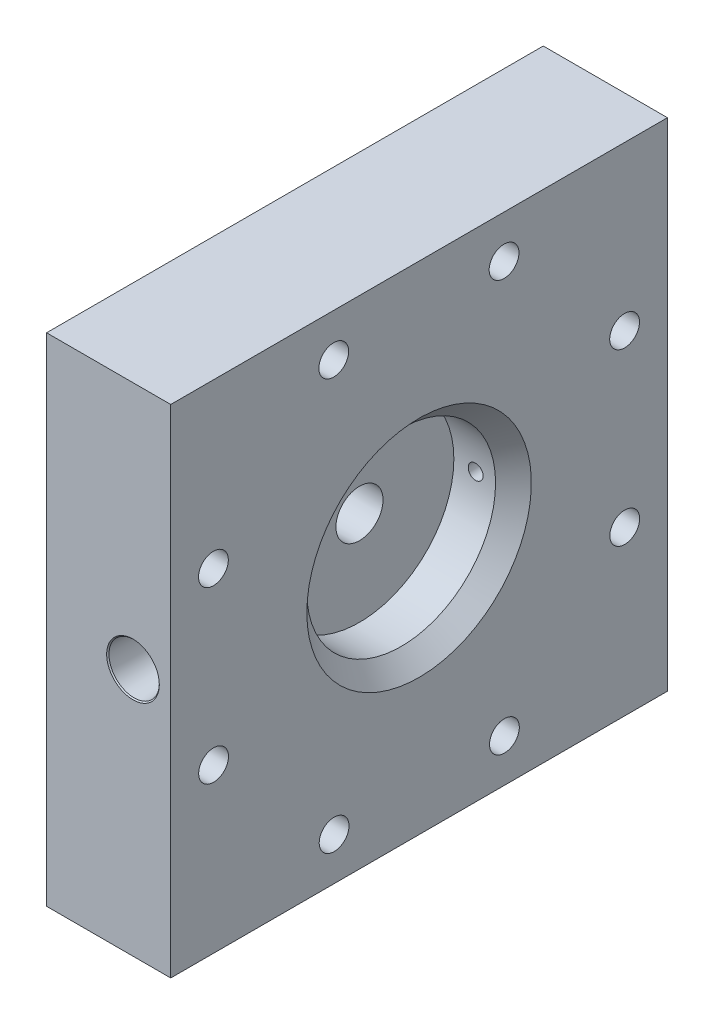
ISO-10303-21;
HEADER;
FILE_DESCRIPTION(('STEP AP214'),'2;1');
FILE_NAME('part.step','',(''),(''),'','','');
FILE_SCHEMA(('AUTOMOTIVE_DESIGN { 1 0 10303 214 1 1 1 1 }'));
ENDSEC;
DATA;
#1=APPLICATION_CONTEXT('core data for automotive mechanical design processes');
#2=APPLICATION_PROTOCOL_DEFINITION('international standard','automotive_design',2000,#1);
#3=PRODUCT_CONTEXT('',#1,'mechanical');
#4=PRODUCT('Part','Part','',(#3));
#5=PRODUCT_RELATED_PRODUCT_CATEGORY('part','',(#4));
#6=PRODUCT_DEFINITION_FORMATION('','',#4);
#7=PRODUCT_DEFINITION_CONTEXT('part definition',#1,'design');
#8=PRODUCT_DEFINITION('design','',#6,#7);
#9=PRODUCT_DEFINITION_SHAPE('','',#8);
#10=(LENGTH_UNIT() NAMED_UNIT(*) SI_UNIT(.MILLI.,.METRE.));
#11=(NAMED_UNIT(*) PLANE_ANGLE_UNIT() SI_UNIT($,.RADIAN.));
#12=(NAMED_UNIT(*) SI_UNIT($,.STERADIAN.) SOLID_ANGLE_UNIT());
#13=UNCERTAINTY_MEASURE_WITH_UNIT(LENGTH_MEASURE(1.E-05),#10,'distance_accuracy_value','');
#14=(GEOMETRIC_REPRESENTATION_CONTEXT(3) GLOBAL_UNCERTAINTY_ASSIGNED_CONTEXT((#13)) GLOBAL_UNIT_ASSIGNED_CONTEXT((#10,
#11,#12)) REPRESENTATION_CONTEXT('',''));
#15=CARTESIAN_POINT('',(0.,0.,0.));
#16=DIRECTION('',(0.,0.,1.));
#17=DIRECTION('',(1.,0.,0.));
#18=AXIS2_PLACEMENT_3D('',#15,#16,#17);
#19=CARTESIAN_POINT('',(-15.24,0.,0.));
#20=DIRECTION('',(1.,0.,0.));
#21=DIRECTION('',(0.,0.,-1.));
#22=AXIS2_PLACEMENT_3D('',#19,#20,#21);
#23=CYLINDRICAL_SURFACE('',#22,24.13);
#24=CARTESIAN_POINT('',(-11.557,0.,-24.13));
#25=CARTESIAN_POINT('',(-11.556995325564,0.106826226172943,-24.129999011352));
#26=CARTESIAN_POINT('',(-11.5479840789725,0.213725661990986,-24.129283034245));
#27=CARTESIAN_POINT('',(-11.5121683328076,0.424568237219932,-24.1264956971331));
#28=CARTESIAN_POINT('',(-11.4853435455417,0.528507864808426,-24.1244227917724));
#29=CARTESIAN_POINT('',(-11.4146800303673,0.73034655500601,-24.1191559058217));
#30=CARTESIAN_POINT('',(-11.3708507771266,0.828248946340492,-24.115962549627));
#31=CARTESIAN_POINT('',(-11.2674390726685,1.01528331461055,-24.1088131242689));
#32=CARTESIAN_POINT('',(-11.2078600467169,1.10441719274882,-24.1048572209951));
#33=CARTESIAN_POINT('',(-11.0744914992284,1.27161355485184,-24.0966165942948));
#34=CARTESIAN_POINT('',(-11.0006732338098,1.34965308025596,-24.0923312164842));
#35=CARTESIAN_POINT('',(-10.8409821381978,1.49224860927596,-24.0839201403949));
#36=CARTESIAN_POINT('',(-10.7551087849377,1.55680402751798,-24.079794449055));
#37=CARTESIAN_POINT('',(-10.573607667086,1.67067537712302,-24.0721626942508));
#38=CARTESIAN_POINT('',(-10.4779673258606,1.7199713217326,-24.0686574459886));
#39=CARTESIAN_POINT('',(-10.279734869153,1.80179668996642,-24.0626707102689));
#40=CARTESIAN_POINT('',(-10.1771428651822,1.83432638246537,-24.0601892063941));
#41=CARTESIAN_POINT('',(-9.96814788168544,1.88162974350117,-24.0565362645601));
#42=CARTESIAN_POINT('',(-9.86175336342215,1.89644058025379,-24.0553620846341));
#43=CARTESIAN_POINT('',(-9.64798247110973,1.90800060951392,-24.0544480090899));
#44=CARTESIAN_POINT('',(-9.54060611380399,1.90475010945183,-24.0547080890584));
#45=CARTESIAN_POINT('',(-9.32817393312756,1.88031047775107,-24.0566306614726));
#46=CARTESIAN_POINT('',(-9.22311343479365,1.8591616986429,-24.0582899991942));
#47=CARTESIAN_POINT('',(-9.01803808839669,1.79958851356738,-24.0628191619755));
#48=CARTESIAN_POINT('',(-8.91802328518451,1.76116395406681,-24.065688997793));
#49=CARTESIAN_POINT('',(-8.72574953492833,1.66808461170782,-24.0723194181394));
#50=CARTESIAN_POINT('',(-8.63349941064074,1.61341167747347,-24.0760809978969));
#51=CARTESIAN_POINT('',(-8.45947013467684,1.48940064822127,-24.0840701198221));
#52=CARTESIAN_POINT('',(-8.37769117304468,1.42006228709693,-24.0882976704444));
#53=CARTESIAN_POINT('',(-8.22669096406,1.26846211833128,-24.0967564074443));
#54=CARTESIAN_POINT('',(-8.15750474313264,1.18616541684066,-24.1009875720386));
#55=CARTESIAN_POINT('',(-8.03392462376757,1.0111065403748,-24.1089657151342));
#56=CARTESIAN_POINT('',(-7.97953073393508,0.918344359311472,-24.1127126933538));
#57=CARTESIAN_POINT('',(-7.88708168232635,0.724965288686751,-24.1193008806083));
#58=CARTESIAN_POINT('',(-7.84902801925965,0.624347679633035,-24.1221420065532));
#59=CARTESIAN_POINT('',(-7.79036388366253,0.418124140058263,-24.1265973811949));
#60=CARTESIAN_POINT('',(-7.769753086244,0.31251830248586,-24.1282116527429));
#61=CARTESIAN_POINT('',(-7.74660354130164,0.0996197390016049,-24.1300284967904));
#62=CARTESIAN_POINT('',(-7.7440164022684,-0.00766769419013197,-24.1302348493641));
#63=CARTESIAN_POINT('',(-7.75686092170936,-0.221150817142489,-24.1292226909866));
#64=CARTESIAN_POINT('',(-7.77229242957319,-0.327346516020977,-24.1280041919451));
#65=CARTESIAN_POINT('',(-7.82069609987958,-0.535494073622205,-24.1242818276586));
#66=CARTESIAN_POINT('',(-7.85364588546931,-0.637451167766453,-24.1217796023152));
#67=CARTESIAN_POINT('',(-7.9361279636865,-0.834389367323965,-24.115770972336));
#68=CARTESIAN_POINT('',(-7.98566049237256,-0.929370373407773,-24.1122645534053));
#69=CARTESIAN_POINT('',(-8.10002398889514,-1.10988078151531,-24.1046313941248));
#70=CARTESIAN_POINT('',(-8.16488707653208,-1.19538977820806,-24.1005033580752));
#71=CARTESIAN_POINT('',(-8.30802398557542,-1.35432303419914,-24.0920952913192));
#72=CARTESIAN_POINT('',(-8.38629801614237,-1.4277471049828,-24.0878152582431));
#73=CARTESIAN_POINT('',(-8.55424460829666,-1.56059177959214,-24.0795744446698));
#74=CARTESIAN_POINT('',(-8.64394215515525,-1.61998084788506,-24.0756143960366));
#75=CARTESIAN_POINT('',(-8.83206495304487,-1.72285357630273,-24.0684720323659));
#76=CARTESIAN_POINT('',(-8.93049012461906,-1.76633738121152,-24.0652897102488));
#77=CARTESIAN_POINT('',(-9.13316175663511,-1.83611130814894,-24.0600670512582));
#78=CARTESIAN_POINT('',(-9.23740149277564,-1.86242086168388,-24.0580254241435));
#79=CARTESIAN_POINT('',(-9.448835655013,-1.89716276665092,-24.0553108867109));
#80=CARTESIAN_POINT('',(-9.5560300307975,-1.90559542230508,-24.0546379531011));
#81=CARTESIAN_POINT('',(-9.77001720042872,-1.90434079817309,-24.0547372870641));
#82=CARTESIAN_POINT('',(-9.87681029015598,-1.89470307269392,-24.055505602311));
#83=CARTESIAN_POINT('',(-10.0872562243671,-1.85768446011846,-24.0583924711154));
#84=CARTESIAN_POINT('',(-10.1909090638186,-1.83030354458974,-24.0605110268367));
#85=CARTESIAN_POINT('',(-10.3921363130125,-1.75858805644799,-24.0658586375874));
#86=CARTESIAN_POINT('',(-10.4897109909264,-1.71425423242271,-24.0690876435821));
#87=CARTESIAN_POINT('',(-10.6760402309025,-1.60989714620257,-24.0762923801623));
#88=CARTESIAN_POINT('',(-10.7647949523223,-1.54987416754795,-24.0802680972526));
#89=CARTESIAN_POINT('',(-10.9312181698313,-1.41565669612741,-24.088531209571));
#90=CARTESIAN_POINT('',(-11.008857132073,-1.3414256315595,-24.0928193910498));
#91=CARTESIAN_POINT('',(-11.1506035314281,-1.18096299810164,-24.1012171237977));
#92=CARTESIAN_POINT('',(-11.2147076815479,-1.0947285225436,-24.105326631483));
#93=CARTESIAN_POINT('',(-11.3276414453039,-0.912556953458347,-24.1129106343319));
#94=CARTESIAN_POINT('',(-11.3764447123768,-0.816603496532759,-24.116384029946));
#95=CARTESIAN_POINT('',(-11.4571856212062,-0.617903301001842,-24.1222912249227));
#96=CARTESIAN_POINT('',(-11.4891427356211,-0.515164560914645,-24.1247262239547));
#97=CARTESIAN_POINT('',(-11.5271060832324,-0.343178619296865,-24.127654108437));
#98=CARTESIAN_POINT('',(-11.5383014973731,-0.275038882367978,-24.128529835367));
#99=CARTESIAN_POINT('',(-11.5532499563865,-0.137942939414719,-24.1297030996988));
#100=CARTESIAN_POINT('',(-11.5570030186789,-0.0689867353017567,-24.1300006384537));
#101=CARTESIAN_POINT('',(-11.557,0.,-24.13));
#102=B_SPLINE_CURVE_WITH_KNOTS('',3,(#24,#25,#26,#27,#28,#29,#30,#31,#32,#33,#34,#35,#36,#37,
#38,#39,#40,#41,#42,#43,#44,#45,#46,#47,#48,#49,#50,#51,#52,#53,#54,#55,#56,#57,#58,#59,#60,#61,
#62,#63,#64,#65,#66,#67,#68,#69,#70,#71,#72,#73,#74,#75,#76,#77,#78,#79,#80,#81,#82,#83,#84,#85,
#86,#87,#88,#89,#90,#91,#92,#93,#94,#95,#96,#97,#98,#99,#100,#101),.UNSPECIFIED.,.T.,.F.,(4,2,2,
2,2,2,2,2,2,2,2,2,2,2,2,2,2,2,2,2,2,2,2,2,2,2,2,2,2,2,2,2,2,2,2,2,2,2,4),(0.,0.320226809727181,
0.640818949999914,0.961232716443689,1.28157685644303,1.60257455387096,1.9235861835987,
2.24501651023551,2.56644168204244,2.88719142277237,3.2079357038884,3.52795877212784,
3.84798468453082,4.16836945662308,4.48876004264693,4.81002860540227,5.13129735505038,
5.45259556486168,5.77388779009066,6.09431704797972,6.41474362755331,6.73476189230492,
7.05478471277313,7.37548406701352,7.69618842341991,8.01760666757768,8.33902198582403,
8.66007301109804,8.98111857280737,9.30128502046014,9.62145198116228,9.9416048059184,
10.2617518451535,10.5827343072053,10.9037946319458,11.2254047916447,11.5466423788078,
11.7534404157516,11.9602379686616),.UNSPECIFIED.);
#103=CARTESIAN_POINT('',(-11.557,0.,-24.13));
#104=VERTEX_POINT('',#103);
#105=EDGE_CURVE('E250',#104,#104,#102,.T.);
#106=ORIENTED_EDGE('',*,*,#105,.T.);
#107=EDGE_LOOP('',(#106));
#108=FACE_BOUND('',#107,.T.);
#109=CARTESIAN_POINT('',(-4.57200000000006,0.,0.));
#110=DIRECTION('',(-1.,0.,0.));
#111=DIRECTION('',(0.,0.,1.));
#112=AXIS2_PLACEMENT_3D('',#109,#110,#111);
#113=CIRCLE('',#112,24.13);
#114=CARTESIAN_POINT('',(-4.57200000000006,0.,24.13));
#115=VERTEX_POINT('',#114);
#116=EDGE_CURVE('E55',#115,#115,#113,.F.);
#117=ORIENTED_EDGE('',*,*,#116,.T.);
#118=EDGE_LOOP('',(#117));
#119=FACE_BOUND('',#118,.T.);
#120=CARTESIAN_POINT('',(-15.24,0.,0.));
#121=DIRECTION('',(1.,0.,0.));
#122=DIRECTION('',(0.,0.,-1.));
#123=AXIS2_PLACEMENT_3D('',#120,#121,#122);
#124=CIRCLE('',#123,24.13);
#125=CARTESIAN_POINT('',(-15.24,0.,-24.13));
#126=VERTEX_POINT('',#125);
#127=EDGE_CURVE('E110',#126,#126,#124,.T.);
#128=ORIENTED_EDGE('',*,*,#127,.F.);
#129=EDGE_LOOP('',(#128));
#130=FACE_BOUND('',#129,.T.);
#131=CARTESIAN_POINT('',(-7.74699999999997,0.,24.13));
#132=CARTESIAN_POINT('',(-7.74700467443597,-0.106826226172944,24.129999011352));
#133=CARTESIAN_POINT('',(-7.75601592102745,-0.213725661990986,24.129283034245));
#134=CARTESIAN_POINT('',(-7.79183166719235,-0.424568237219932,24.1264956971331));
#135=CARTESIAN_POINT('',(-7.81865645445828,-0.528507864808426,24.1244227917724));
#136=CARTESIAN_POINT('',(-7.88931996963259,-0.73034655500601,24.1191559058217));
#137=CARTESIAN_POINT('',(-7.93314922287336,-0.828248946340492,24.115962549627));
#138=CARTESIAN_POINT('',(-8.03656092733144,-1.01528331461055,24.1088131242689));
#139=CARTESIAN_POINT('',(-8.09613995328301,-1.10441719274882,24.1048572209951));
#140=CARTESIAN_POINT('',(-8.22950850077149,-1.27161355485184,24.0966165942948));
#141=CARTESIAN_POINT('',(-8.30332676619009,-1.34965308025596,24.0923312164842));
#142=CARTESIAN_POINT('',(-8.46301786180214,-1.49224860927596,24.0839201403949));
#143=CARTESIAN_POINT('',(-8.54889121506219,-1.55680402751798,24.079794449055));
#144=CARTESIAN_POINT('',(-8.73039233291389,-1.67067537712302,24.0721626942508));
#145=CARTESIAN_POINT('',(-8.82603267413938,-1.7199713217326,24.0686574459886));
#146=CARTESIAN_POINT('',(-9.02426513084695,-1.80179668996642,24.0626707102689));
#147=CARTESIAN_POINT('',(-9.1268571348177,-1.83432638246537,24.0601892063941));
#148=CARTESIAN_POINT('',(-9.33585211831449,-1.88162974350117,24.0565362645601));
#149=CARTESIAN_POINT('',(-9.44224663657778,-1.89644058025379,24.0553620846341));
#150=CARTESIAN_POINT('',(-9.6560175288902,-1.90800060951392,24.0544480090899));
#151=CARTESIAN_POINT('',(-9.76339388619594,-1.90475010945183,24.0547080890584));
#152=CARTESIAN_POINT('',(-9.97582606687237,-1.88031047775107,24.0566306614726));
#153=CARTESIAN_POINT('',(-10.0808865652063,-1.8591616986429,24.0582899991942));
#154=CARTESIAN_POINT('',(-10.2859619116032,-1.79958851356738,24.0628191619755));
#155=CARTESIAN_POINT('',(-10.3859767148154,-1.76116395406681,24.065688997793));
#156=CARTESIAN_POINT('',(-10.5782504650716,-1.66808461170782,24.0723194181394));
#157=CARTESIAN_POINT('',(-10.6705005893592,-1.61341167747347,24.0760809978969));
#158=CARTESIAN_POINT('',(-10.8445298653231,-1.48940064822127,24.0840701198221));
#159=CARTESIAN_POINT('',(-10.9263088269553,-1.42006228709693,24.0882976704444));
#160=CARTESIAN_POINT('',(-11.0773090359399,-1.26846211833128,24.0967564074443));
#161=CARTESIAN_POINT('',(-11.1464952568673,-1.18616541684066,24.1009875720386));
#162=CARTESIAN_POINT('',(-11.2700753762324,-1.0111065403748,24.1089657151342));
#163=CARTESIAN_POINT('',(-11.3244692660649,-0.918344359311472,24.1127126933538));
#164=CARTESIAN_POINT('',(-11.4169183176736,-0.724965288686751,24.1193008806083));
#165=CARTESIAN_POINT('',(-11.4549719807403,-0.624347679633035,24.1221420065532));
#166=CARTESIAN_POINT('',(-11.5136361163374,-0.418124140058263,24.1265973811949));
#167=CARTESIAN_POINT('',(-11.5342469137559,-0.31251830248586,24.1282116527429));
#168=CARTESIAN_POINT('',(-11.5573964586983,-0.0996197390016042,24.1300284967904));
#169=CARTESIAN_POINT('',(-11.5599835977315,0.00766769419013236,24.1302348493641));
#170=CARTESIAN_POINT('',(-11.5471390782906,0.221150817142489,24.1292226909866));
#171=CARTESIAN_POINT('',(-11.5317075704267,0.327346516020978,24.1280041919451));
#172=CARTESIAN_POINT('',(-11.4833039001204,0.535494073622205,24.1242818276586));
#173=CARTESIAN_POINT('',(-11.4503541145306,0.637451167766453,24.1217796023152));
#174=CARTESIAN_POINT('',(-11.3678720363134,0.834389367323965,24.115770972336));
#175=CARTESIAN_POINT('',(-11.3183395076274,0.929370373407774,24.1122645534053));
#176=CARTESIAN_POINT('',(-11.2039760111048,1.10988078151531,24.1046313941248));
#177=CARTESIAN_POINT('',(-11.1391129234678,1.19538977820806,24.1005033580752));
#178=CARTESIAN_POINT('',(-10.9959760144245,1.35432303419914,24.0920952913192));
#179=CARTESIAN_POINT('',(-10.9177019838576,1.4277471049828,24.0878152582431));
#180=CARTESIAN_POINT('',(-10.7497553917033,1.56059177959214,24.0795744446698));
#181=CARTESIAN_POINT('',(-10.6600578448447,1.61998084788506,24.0756143960366));
#182=CARTESIAN_POINT('',(-10.4719350469551,1.72285357630273,24.0684720323659));
#183=CARTESIAN_POINT('',(-10.3735098753809,1.76633738121152,24.0652897102488));
#184=CARTESIAN_POINT('',(-10.1708382433648,1.83611130814894,24.0600670512582));
#185=CARTESIAN_POINT('',(-10.0665985072243,1.86242086168388,24.0580254241435));
#186=CARTESIAN_POINT('',(-9.85516434498693,1.89716276665092,24.0553108867109));
#187=CARTESIAN_POINT('',(-9.74796996920243,1.90559542230508,24.0546379531011));
#188=CARTESIAN_POINT('',(-9.53398279957121,1.90434079817309,24.0547372870641));
#189=CARTESIAN_POINT('',(-9.42718970984395,1.89470307269392,24.055505602311));
#190=CARTESIAN_POINT('',(-9.21674377563283,1.85768446011846,24.0583924711154));
#191=CARTESIAN_POINT('',(-9.11309093618132,1.83030354458974,24.0605110268367));
#192=CARTESIAN_POINT('',(-8.91186368698745,1.75858805644799,24.0658586375874));
#193=CARTESIAN_POINT('',(-8.81428900907356,1.71425423242271,24.0690876435821));
#194=CARTESIAN_POINT('',(-8.62795976909744,1.60989714620257,24.0762923801623));
#195=CARTESIAN_POINT('',(-8.53920504767766,1.54987416754795,24.0802680972526));
#196=CARTESIAN_POINT('',(-8.37278183016863,1.41565669612741,24.088531209571));
#197=CARTESIAN_POINT('',(-8.29514286792697,1.3414256315595,24.0928193910498));
#198=CARTESIAN_POINT('',(-8.15339646857182,1.18096299810164,24.1012171237977));
#199=CARTESIAN_POINT('',(-8.08929231845207,1.0947285225436,24.105326631483));
#200=CARTESIAN_POINT('',(-7.97635855469602,0.912556953458346,24.1129106343319));
#201=CARTESIAN_POINT('',(-7.92755528762315,0.816603496532758,24.116384029946));
#202=CARTESIAN_POINT('',(-7.84681437879378,0.617903301001841,24.1222912249227));
#203=CARTESIAN_POINT('',(-7.81485726437881,0.515164560914645,24.1247262239547));
#204=CARTESIAN_POINT('',(-7.77689391676755,0.343178619296865,24.127654108437));
#205=CARTESIAN_POINT('',(-7.76569850262684,0.275038882367978,24.128529835367));
#206=CARTESIAN_POINT('',(-7.75075004361339,0.137942939414719,24.1297030996988));
#207=CARTESIAN_POINT('',(-7.74699698132103,0.0689867353017568,24.1300006384537));
#208=CARTESIAN_POINT('',(-7.74699999999997,0.,24.13));
#209=B_SPLINE_CURVE_WITH_KNOTS('',3,(#131,#132,#133,#134,#135,#136,#137,#138,#139,#140,#141,
#142,#143,#144,#145,#146,#147,#148,#149,#150,#151,#152,#153,#154,#155,#156,#157,#158,#159,#160,
#161,#162,#163,#164,#165,#166,#167,#168,#169,#170,#171,#172,#173,#174,#175,#176,#177,#178,#179,
#180,#181,#182,#183,#184,#185,#186,#187,#188,#189,#190,#191,#192,#193,#194,#195,#196,#197,#198,
#199,#200,#201,#202,#203,#204,#205,#206,#207,#208),.UNSPECIFIED.,.T.,.F.,(4,2,2,2,2,2,2,2,2,2,2,
2,2,2,2,2,2,2,2,2,2,2,2,2,2,2,2,2,2,2,2,2,2,2,2,2,2,2,4),(0.,0.320226809727181,
0.640818949999914,0.961232716443689,1.28157685644303,1.60257455387096,1.9235861835987,
2.24501651023551,2.56644168204244,2.88719142277237,3.2079357038884,3.52795877212784,
3.84798468453082,4.16836945662308,4.48876004264693,4.81002860540227,5.13129735505038,
5.45259556486168,5.77388779009066,6.09431704797972,6.41474362755331,6.73476189230492,
7.05478471277313,7.37548406701353,7.69618842341991,8.01760666757768,8.33902198582403,
8.66007301109804,8.98111857280738,9.30128502046014,9.62145198116228,9.9416048059184,
10.2617518451535,10.5827343072054,10.9037946319458,11.2254047916447,11.5466423788078,
11.7534404157516,11.9602379686616),.UNSPECIFIED.);
#210=CARTESIAN_POINT('',(-7.74699999999997,0.,24.13));
#211=VERTEX_POINT('',#210);
#212=EDGE_CURVE('E115',#211,#211,#209,.T.);
#213=ORIENTED_EDGE('',*,*,#212,.F.);
#214=EDGE_LOOP('',(#213));
#215=FACE_BOUND('',#214,.T.);
#216=ADVANCED_FACE('F45',(#108,#119,#130,#215),#23,.F.);
#217=CARTESIAN_POINT('',(-31.75,0.,0.));
#218=DIRECTION('',(-1.,0.,0.));
#219=DIRECTION('',(0.,0.,1.));
#220=AXIS2_PLACEMENT_3D('',#217,#218,#219);
#221=PLANE('',#220);
#222=CARTESIAN_POINT('',(-31.75,0.,0.));
#223=DIRECTION('',(-1.,0.,0.));
#224=DIRECTION('',(0.,0.,1.));
#225=AXIS2_PLACEMENT_3D('',#222,#223,#224);
#226=CIRCLE('',#225,6.731);
#227=CARTESIAN_POINT('',(-31.75,0.,6.731));
#228=VERTEX_POINT('',#227);
#229=EDGE_CURVE('E181',#228,#228,#226,.T.);
#230=ORIENTED_EDGE('',*,*,#229,.F.);
#231=EDGE_LOOP('',(#230));
#232=FACE_BOUND('',#231,.T.);
#233=CARTESIAN_POINT('',(-31.75,52.546029205355,21.8190199310139));
#234=DIRECTION('',(-1.,0.,0.));
#235=DIRECTION('',(0.,-0.707106781186539,0.707106781186556));
#236=AXIS2_PLACEMENT_3D('',#233,#234,#235);
#237=CIRCLE('',#236,3.81);
#238=CARTESIAN_POINT('',(-31.75,49.8519523690343,24.5130967673347));
#239=VERTEX_POINT('',#238);
#240=EDGE_CURVE('E162',#239,#239,#237,.T.);
#241=ORIENTED_EDGE('',*,*,#240,.F.);
#242=EDGE_LOOP('',(#241));
#243=FACE_BOUND('',#242,.T.);
#244=CARTESIAN_POINT('',(-31.75,21.7272766234684,52.5840305275973));
#245=DIRECTION('',(-1.,0.,0.));
#246=DIRECTION('',(0.,-1.,0.));
#247=AXIS2_PLACEMENT_3D('',#244,#245,#246);
#248=CIRCLE('',#247,3.81);
#249=CARTESIAN_POINT('',(-31.75,17.9172766234684,52.5840305275973));
#250=VERTEX_POINT('',#249);
#251=EDGE_CURVE('E156',#250,#250,#248,.T.);
#252=ORIENTED_EDGE('',*,*,#251,.F.);
#253=EDGE_LOOP('',(#252));
#254=FACE_BOUND('',#253,.T.);
#255=CARTESIAN_POINT('',(-31.75,-21.8190199310141,52.5460292053549));
#256=DIRECTION('',(-1.,0.,0.));
#257=DIRECTION('',(0.,-0.707106781186554,-0.707106781186541));
#258=AXIS2_PLACEMENT_3D('',#255,#256,#257);
#259=CIRCLE('',#258,3.81);
#260=CARTESIAN_POINT('',(-31.75,-24.5130967673349,49.8519523690342));
#261=VERTEX_POINT('',#260);
#262=EDGE_CURVE('E150',#261,#261,#259,.T.);
#263=ORIENTED_EDGE('',*,*,#262,.F.);
#264=EDGE_LOOP('',(#263));
#265=FACE_BOUND('',#264,.T.);
#266=CARTESIAN_POINT('',(-31.75,-52.5840305275975,21.7272766234679));
#267=DIRECTION('',(-1.,0.,0.));
#268=DIRECTION('',(0.,0.,-1.));
#269=AXIS2_PLACEMENT_3D('',#266,#267,#268);
#270=CIRCLE('',#269,3.81);
#271=CARTESIAN_POINT('',(-31.75,-52.5840305275975,17.9172766234679));
#272=VERTEX_POINT('',#271);
#273=EDGE_CURVE('E144',#272,#272,#270,.T.);
#274=ORIENTED_EDGE('',*,*,#273,.F.);
#275=EDGE_LOOP('',(#274));
#276=FACE_BOUND('',#275,.T.);
#277=CARTESIAN_POINT('',(-31.75,-52.5460292053548,-21.8190199310143));
#278=DIRECTION('',(-1.,0.,0.));
#279=DIRECTION('',(0.,0.707106781186544,-0.707106781186551));
#280=AXIS2_PLACEMENT_3D('',#277,#278,#279);
#281=CIRCLE('',#280,3.81);
#282=CARTESIAN_POINT('',(-31.75,-49.8519523690341,-24.513096767335));
#283=VERTEX_POINT('',#282);
#284=EDGE_CURVE('E138',#283,#283,#281,.T.);
#285=ORIENTED_EDGE('',*,*,#284,.F.);
#286=EDGE_LOOP('',(#285));
#287=FACE_BOUND('',#286,.T.);
#288=CARTESIAN_POINT('',(-31.75,-21.727276623468,-52.5840305275974));
#289=DIRECTION('',(-1.,0.,0.));
#290=DIRECTION('',(0.,1.,0.));
#291=AXIS2_PLACEMENT_3D('',#288,#289,#290);
#292=CIRCLE('',#291,3.81);
#293=CARTESIAN_POINT('',(-31.75,-17.917276623468,-52.5840305275974));
#294=VERTEX_POINT('',#293);
#295=EDGE_CURVE('E131',#294,#294,#292,.T.);
#296=ORIENTED_EDGE('',*,*,#295,.F.);
#297=EDGE_LOOP('',(#296));
#298=FACE_BOUND('',#297,.T.);
#299=CARTESIAN_POINT('',(-31.75,21.8190199310145,-52.5460292053547));
#300=DIRECTION('',(-1.,0.,0.));
#301=DIRECTION('',(0.,0.707106781186549,0.707106781186546));
#302=AXIS2_PLACEMENT_3D('',#299,#300,#301);
#303=CIRCLE('',#302,3.81);
#304=CARTESIAN_POINT('',(-31.75,24.5130967673352,-49.851952369034));
#305=VERTEX_POINT('',#304);
#306=EDGE_CURVE('E167',#305,#305,#303,.T.);
#307=ORIENTED_EDGE('',*,*,#306,.F.);
#308=EDGE_LOOP('',(#307));
#309=FACE_BOUND('',#308,.T.);
#310=CARTESIAN_POINT('',(-31.75,52.5840305275975,-21.7272766234679));
#311=DIRECTION('',(-1.,0.,0.));
#312=DIRECTION('',(0.,0.,1.));
#313=AXIS2_PLACEMENT_3D('',#310,#311,#312);
#314=CIRCLE('',#313,3.81);
#315=CARTESIAN_POINT('',(-31.75,52.5840305275975,-17.9172766234679));
#316=VERTEX_POINT('',#315);
#317=EDGE_CURVE('E173',#316,#316,#314,.T.);
#318=ORIENTED_EDGE('',*,*,#317,.F.);
#319=EDGE_LOOP('',(#318));
#320=FACE_BOUND('',#319,.T.);
#321=DIRECTION('',(0.,1.,0.));
#322=VECTOR('',#321,1.);
#323=CARTESIAN_POINT('',(-31.75,0.,-63.5));
#324=LINE('',#323,#322);
#325=CARTESIAN_POINT('',(-31.75,-63.5,-63.5));
#326=VERTEX_POINT('',#325);
#327=CARTESIAN_POINT('',(-31.75,63.5,-63.5));
#328=VERTEX_POINT('',#327);
#329=EDGE_CURVE('E89',#326,#328,#324,.T.);
#330=ORIENTED_EDGE('',*,*,#329,.F.);
#331=DIRECTION('',(0.,0.,1.));
#332=VECTOR('',#331,1.);
#333=CARTESIAN_POINT('',(-31.75,-63.5,0.));
#334=LINE('',#333,#332);
#335=CARTESIAN_POINT('',(-31.75,-63.5,63.5));
#336=VERTEX_POINT('',#335);
#337=EDGE_CURVE('E93',#326,#336,#334,.T.);
#338=ORIENTED_EDGE('',*,*,#337,.T.);
#339=DIRECTION('',(0.,1.,0.));
#340=VECTOR('',#339,1.);
#341=CARTESIAN_POINT('',(-31.75,0.,63.5));
#342=LINE('',#341,#340);
#343=CARTESIAN_POINT('',(-31.75,63.5000000000001,63.5));
#344=VERTEX_POINT('',#343);
#345=EDGE_CURVE('E106',#336,#344,#342,.T.);
#346=ORIENTED_EDGE('',*,*,#345,.T.);
#347=DIRECTION('',(0.,0.,1.));
#348=VECTOR('',#347,1.);
#349=CARTESIAN_POINT('',(-31.75,63.5,0.));
#350=LINE('',#349,#348);
#351=EDGE_CURVE('E94',#328,#344,#350,.T.);
#352=ORIENTED_EDGE('',*,*,#351,.F.);
#353=EDGE_LOOP('',(#330,#338,#346,#352));
#354=FACE_BOUND('',#353,.T.);
#355=ADVANCED_FACE('F91',(#232,#243,#254,#265,#276,#287,#298,#309,#320,#354),#221,.T.);
#356=CARTESIAN_POINT('',(0.,0.,0.));
#357=DIRECTION('',(-1.,0.,0.));
#358=DIRECTION('',(0.,0.,1.));
#359=AXIS2_PLACEMENT_3D('',#356,#357,#358);
#360=PLANE('',#359);
#361=CARTESIAN_POINT('',(0.,0.,0.));
#362=DIRECTION('',(-1.,0.,0.));
#363=DIRECTION('',(0.,0.,1.));
#364=AXIS2_PLACEMENT_3D('',#361,#362,#363);
#365=CIRCLE('',#364,28.7020000000001);
#366=CARTESIAN_POINT('',(0.,0.,28.7020000000001));
#367=VERTEX_POINT('',#366);
#368=EDGE_CURVE('E11',#367,#367,#365,.T.);
#369=ORIENTED_EDGE('',*,*,#368,.T.);
#370=EDGE_LOOP('',(#369));
#371=FACE_BOUND('',#370,.T.);
#372=CARTESIAN_POINT('',(0.,52.546029205355,21.8190199310139));
#373=DIRECTION('',(-1.,0.,0.));
#374=DIRECTION('',(0.,-0.707106781186539,0.707106781186556));
#375=AXIS2_PLACEMENT_3D('',#372,#373,#374);
#376=CIRCLE('',#375,3.81);
#377=CARTESIAN_POINT('',(0.,49.8519523690343,24.5130967673347));
#378=VERTEX_POINT('',#377);
#379=EDGE_CURVE('E127',#378,#378,#376,.T.);
#380=ORIENTED_EDGE('',*,*,#379,.T.);
#381=EDGE_LOOP('',(#380));
#382=FACE_BOUND('',#381,.T.);
#383=CARTESIAN_POINT('',(0.,21.7272766234684,52.5840305275973));
#384=DIRECTION('',(-1.,0.,0.));
#385=DIRECTION('',(0.,-1.,0.));
#386=AXIS2_PLACEMENT_3D('',#383,#384,#385);
#387=CIRCLE('',#386,3.81);
#388=CARTESIAN_POINT('',(0.,17.9172766234684,52.5840305275973));
#389=VERTEX_POINT('',#388);
#390=EDGE_CURVE('E159',#389,#389,#387,.T.);
#391=ORIENTED_EDGE('',*,*,#390,.T.);
#392=EDGE_LOOP('',(#391));
#393=FACE_BOUND('',#392,.T.);
#394=CARTESIAN_POINT('',(0.,-21.8190199310141,52.5460292053549));
#395=DIRECTION('',(-1.,0.,0.));
#396=DIRECTION('',(0.,-0.707106781186554,-0.707106781186541));
#397=AXIS2_PLACEMENT_3D('',#394,#395,#396);
#398=CIRCLE('',#397,3.81);
#399=CARTESIAN_POINT('',(0.,-24.5130967673349,49.8519523690342));
#400=VERTEX_POINT('',#399);
#401=EDGE_CURVE('E153',#400,#400,#398,.T.);
#402=ORIENTED_EDGE('',*,*,#401,.T.);
#403=EDGE_LOOP('',(#402));
#404=FACE_BOUND('',#403,.T.);
#405=CARTESIAN_POINT('',(0.,-52.5840305275975,21.7272766234679));
#406=DIRECTION('',(-1.,0.,0.));
#407=DIRECTION('',(0.,0.,-1.));
#408=AXIS2_PLACEMENT_3D('',#405,#406,#407);
#409=CIRCLE('',#408,3.81);
#410=CARTESIAN_POINT('',(0.,-52.5840305275975,17.9172766234679));
#411=VERTEX_POINT('',#410);
#412=EDGE_CURVE('E147',#411,#411,#409,.T.);
#413=ORIENTED_EDGE('',*,*,#412,.T.);
#414=EDGE_LOOP('',(#413));
#415=FACE_BOUND('',#414,.T.);
#416=CARTESIAN_POINT('',(0.,-52.5460292053548,-21.8190199310143));
#417=DIRECTION('',(-1.,0.,0.));
#418=DIRECTION('',(0.,0.707106781186544,-0.707106781186551));
#419=AXIS2_PLACEMENT_3D('',#416,#417,#418);
#420=CIRCLE('',#419,3.81);
#421=CARTESIAN_POINT('',(0.,-49.8519523690341,-24.513096767335));
#422=VERTEX_POINT('',#421);
#423=EDGE_CURVE('E141',#422,#422,#420,.T.);
#424=ORIENTED_EDGE('',*,*,#423,.T.);
#425=EDGE_LOOP('',(#424));
#426=FACE_BOUND('',#425,.T.);
#427=CARTESIAN_POINT('',(0.,-21.727276623468,-52.5840305275974));
#428=DIRECTION('',(-1.,0.,0.));
#429=DIRECTION('',(0.,1.,0.));
#430=AXIS2_PLACEMENT_3D('',#427,#428,#429);
#431=CIRCLE('',#430,3.81);
#432=CARTESIAN_POINT('',(0.,-17.917276623468,-52.5840305275974));
#433=VERTEX_POINT('',#432);
#434=EDGE_CURVE('E135',#433,#433,#431,.T.);
#435=ORIENTED_EDGE('',*,*,#434,.T.);
#436=EDGE_LOOP('',(#435));
#437=FACE_BOUND('',#436,.T.);
#438=CARTESIAN_POINT('',(0.,21.8190199310145,-52.5460292053547));
#439=DIRECTION('',(-1.,0.,0.));
#440=DIRECTION('',(0.,0.707106781186549,0.707106781186546));
#441=AXIS2_PLACEMENT_3D('',#438,#439,#440);
#442=CIRCLE('',#441,3.81);
#443=CARTESIAN_POINT('',(0.,24.5130967673352,-49.851952369034));
#444=VERTEX_POINT('',#443);
#445=EDGE_CURVE('E134',#444,#444,#442,.T.);
#446=ORIENTED_EDGE('',*,*,#445,.T.);
#447=EDGE_LOOP('',(#446));
#448=FACE_BOUND('',#447,.T.);
#449=CARTESIAN_POINT('',(0.,52.5840305275975,-21.7272766234679));
#450=DIRECTION('',(-1.,0.,0.));
#451=DIRECTION('',(0.,0.,1.));
#452=AXIS2_PLACEMENT_3D('',#449,#450,#451);
#453=CIRCLE('',#452,3.81);
#454=CARTESIAN_POINT('',(0.,52.5840305275975,-17.9172766234679));
#455=VERTEX_POINT('',#454);
#456=EDGE_CURVE('E170',#455,#455,#453,.T.);
#457=ORIENTED_EDGE('',*,*,#456,.T.);
#458=EDGE_LOOP('',(#457));
#459=FACE_BOUND('',#458,.T.);
#460=DIRECTION('',(0.,0.,-1.));
#461=VECTOR('',#460,1.);
#462=CARTESIAN_POINT('',(0.,-63.5,0.));
#463=LINE('',#462,#461);
#464=CARTESIAN_POINT('',(0.,-63.5,63.5));
#465=VERTEX_POINT('',#464);
#466=CARTESIAN_POINT('',(0.,-63.5,-63.5));
#467=VERTEX_POINT('',#466);
#468=EDGE_CURVE('E119',#465,#467,#463,.T.);
#469=ORIENTED_EDGE('',*,*,#468,.T.);
#470=DIRECTION('',(0.,-1.,0.));
#471=VECTOR('',#470,1.);
#472=CARTESIAN_POINT('',(0.,0.,-63.5));
#473=LINE('',#472,#471);
#474=CARTESIAN_POINT('',(0.,63.5,-63.5));
#475=VERTEX_POINT('',#474);
#476=EDGE_CURVE('E63',#475,#467,#473,.T.);
#477=ORIENTED_EDGE('',*,*,#476,.F.);
#478=DIRECTION('',(0.,0.,-1.));
#479=VECTOR('',#478,1.);
#480=CARTESIAN_POINT('',(0.,63.5,0.));
#481=LINE('',#480,#479);
#482=CARTESIAN_POINT('',(0.,63.5000000000001,63.5));
#483=VERTEX_POINT('',#482);
#484=EDGE_CURVE('E125',#483,#475,#481,.T.);
#485=ORIENTED_EDGE('',*,*,#484,.F.);
#486=DIRECTION('',(0.,-1.,0.));
#487=VECTOR('',#486,1.);
#488=CARTESIAN_POINT('',(0.,0.,63.5));
#489=LINE('',#488,#487);
#490=EDGE_CURVE('E120',#483,#465,#489,.T.);
#491=ORIENTED_EDGE('',*,*,#490,.T.);
#492=EDGE_LOOP('',(#469,#477,#485,#491));
#493=FACE_BOUND('',#492,.T.);
#494=ADVANCED_FACE('F280',(#371,#382,#393,#404,#415,#426,#437,#448,#459,#493),#360,.F.);
#495=CARTESIAN_POINT('',(-31.75,52.5840305275975,-21.7272766234679));
#496=DIRECTION('',(1.,0.,0.));
#497=DIRECTION('',(0.,0.,-1.));
#498=AXIS2_PLACEMENT_3D('',#495,#496,#497);
#499=CYLINDRICAL_SURFACE('',#498,3.81);
#500=ORIENTED_EDGE('',*,*,#317,.T.);
#501=EDGE_LOOP('',(#500));
#502=FACE_BOUND('',#501,.T.);
#503=ORIENTED_EDGE('',*,*,#456,.F.);
#504=EDGE_LOOP('',(#503));
#505=FACE_BOUND('',#504,.T.);
#506=ADVANCED_FACE('F282',(#502,#505),#499,.F.);
#507=CARTESIAN_POINT('',(-31.75,21.8190199310145,-52.5460292053547));
#508=DIRECTION('',(1.,0.,0.));
#509=DIRECTION('',(0.,0.,-1.));
#510=AXIS2_PLACEMENT_3D('',#507,#508,#509);
#511=CYLINDRICAL_SURFACE('',#510,3.81);
#512=ORIENTED_EDGE('',*,*,#306,.T.);
#513=EDGE_LOOP('',(#512));
#514=FACE_BOUND('',#513,.T.);
#515=ORIENTED_EDGE('',*,*,#445,.F.);
#516=EDGE_LOOP('',(#515));
#517=FACE_BOUND('',#516,.T.);
#518=ADVANCED_FACE('F288',(#514,#517),#511,.F.);
#519=CARTESIAN_POINT('',(-31.75,-21.727276623468,-52.5840305275974));
#520=DIRECTION('',(1.,0.,0.));
#521=DIRECTION('',(0.,0.,-1.));
#522=AXIS2_PLACEMENT_3D('',#519,#520,#521);
#523=CYLINDRICAL_SURFACE('',#522,3.81);
#524=ORIENTED_EDGE('',*,*,#295,.T.);
#525=EDGE_LOOP('',(#524));
#526=FACE_BOUND('',#525,.T.);
#527=ORIENTED_EDGE('',*,*,#434,.F.);
#528=EDGE_LOOP('',(#527));
#529=FACE_BOUND('',#528,.T.);
#530=ADVANCED_FACE('F310',(#526,#529),#523,.F.);
#531=CARTESIAN_POINT('',(-31.75,-52.5460292053548,-21.8190199310143));
#532=DIRECTION('',(1.,0.,0.));
#533=DIRECTION('',(0.,0.,-1.));
#534=AXIS2_PLACEMENT_3D('',#531,#532,#533);
#535=CYLINDRICAL_SURFACE('',#534,3.81);
#536=ORIENTED_EDGE('',*,*,#284,.T.);
#537=EDGE_LOOP('',(#536));
#538=FACE_BOUND('',#537,.T.);
#539=ORIENTED_EDGE('',*,*,#423,.F.);
#540=EDGE_LOOP('',(#539));
#541=FACE_BOUND('',#540,.T.);
#542=ADVANCED_FACE('F313',(#538,#541),#535,.F.);
#543=CARTESIAN_POINT('',(-31.75,-52.5840305275975,21.7272766234679));
#544=DIRECTION('',(1.,0.,0.));
#545=DIRECTION('',(0.,0.,-1.));
#546=AXIS2_PLACEMENT_3D('',#543,#544,#545);
#547=CYLINDRICAL_SURFACE('',#546,3.81);
#548=ORIENTED_EDGE('',*,*,#273,.T.);
#549=EDGE_LOOP('',(#548));
#550=FACE_BOUND('',#549,.T.);
#551=ORIENTED_EDGE('',*,*,#412,.F.);
#552=EDGE_LOOP('',(#551));
#553=FACE_BOUND('',#552,.T.);
#554=ADVANCED_FACE('F317',(#550,#553),#547,.F.);
#555=CARTESIAN_POINT('',(-31.75,-21.8190199310141,52.5460292053549));
#556=DIRECTION('',(1.,0.,0.));
#557=DIRECTION('',(0.,0.,-1.));
#558=AXIS2_PLACEMENT_3D('',#555,#556,#557);
#559=CYLINDRICAL_SURFACE('',#558,3.81);
#560=ORIENTED_EDGE('',*,*,#262,.T.);
#561=EDGE_LOOP('',(#560));
#562=FACE_BOUND('',#561,.T.);
#563=ORIENTED_EDGE('',*,*,#401,.F.);
#564=EDGE_LOOP('',(#563));
#565=FACE_BOUND('',#564,.T.);
#566=ADVANCED_FACE('F321',(#562,#565),#559,.F.);
#567=CARTESIAN_POINT('',(-31.75,21.7272766234684,52.5840305275973));
#568=DIRECTION('',(1.,0.,0.));
#569=DIRECTION('',(0.,0.,-1.));
#570=AXIS2_PLACEMENT_3D('',#567,#568,#569);
#571=CYLINDRICAL_SURFACE('',#570,3.81);
#572=ORIENTED_EDGE('',*,*,#251,.T.);
#573=EDGE_LOOP('',(#572));
#574=FACE_BOUND('',#573,.T.);
#575=ORIENTED_EDGE('',*,*,#390,.F.);
#576=EDGE_LOOP('',(#575));
#577=FACE_BOUND('',#576,.T.);
#578=ADVANCED_FACE('F325',(#574,#577),#571,.F.);
#579=CARTESIAN_POINT('',(-31.75,52.546029205355,21.8190199310139));
#580=DIRECTION('',(1.,0.,0.));
#581=DIRECTION('',(0.,0.,-1.));
#582=AXIS2_PLACEMENT_3D('',#579,#580,#581);
#583=CYLINDRICAL_SURFACE('',#582,3.81);
#584=ORIENTED_EDGE('',*,*,#240,.T.);
#585=EDGE_LOOP('',(#584));
#586=FACE_BOUND('',#585,.T.);
#587=ORIENTED_EDGE('',*,*,#379,.F.);
#588=EDGE_LOOP('',(#587));
#589=FACE_BOUND('',#588,.T.);
#590=ADVANCED_FACE('F306',(#586,#589),#583,.F.);
#591=CARTESIAN_POINT('',(89.8025612106916,0.,-63.5));
#592=DIRECTION('',(0.,0.,1.));
#593=DIRECTION('',(1.,0.,0.));
#594=AXIS2_PLACEMENT_3D('',#591,#592,#593);
#595=PLANE('',#594);
#596=CARTESIAN_POINT('',(-9.65199999999997,0.,-63.5));
#597=DIRECTION('',(0.,0.,-1.));
#598=DIRECTION('',(-1.,0.,0.));
#599=AXIS2_PLACEMENT_3D('',#596,#597,#598);
#600=CIRCLE('',#599,6.731);
#601=CARTESIAN_POINT('',(-16.383,0.,-63.5));
#602=VERTEX_POINT('',#601);
#603=EDGE_CURVE('E706',#602,#602,#600,.T.);
#604=ORIENTED_EDGE('',*,*,#603,.F.);
#605=EDGE_LOOP('',(#604));
#606=FACE_BOUND('',#605,.T.);
#607=DIRECTION('',(-1.,0.,0.));
#608=VECTOR('',#607,1.);
#609=CARTESIAN_POINT('',(89.8025612106916,63.5,-63.5));
#610=LINE('',#609,#608);
#611=EDGE_CURVE('E70',#475,#328,#610,.T.);
#612=ORIENTED_EDGE('',*,*,#611,.F.);
#613=ORIENTED_EDGE('',*,*,#476,.T.);
#614=DIRECTION('',(-1.,0.,0.));
#615=VECTOR('',#614,1.);
#616=CARTESIAN_POINT('',(89.8025612106916,-63.5,-63.5));
#617=LINE('',#616,#615);
#618=EDGE_CURVE('E102',#467,#326,#617,.T.);
#619=ORIENTED_EDGE('',*,*,#618,.T.);
#620=ORIENTED_EDGE('',*,*,#329,.T.);
#621=EDGE_LOOP('',(#612,#613,#619,#620));
#622=FACE_BOUND('',#621,.T.);
#623=ADVANCED_FACE('F109',(#606,#622),#595,.F.);
#624=CARTESIAN_POINT('',(89.8025612106916,63.5,0.));
#625=DIRECTION('',(0.,-1.,0.));
#626=DIRECTION('',(0.,0.,-1.));
#627=AXIS2_PLACEMENT_3D('',#624,#625,#626);
#628=PLANE('',#627);
#629=ORIENTED_EDGE('',*,*,#351,.T.);
#630=DIRECTION('',(-1.,0.,0.));
#631=VECTOR('',#630,1.);
#632=CARTESIAN_POINT('',(89.8025612106916,63.5000000000001,63.5));
#633=LINE('',#632,#631);
#634=EDGE_CURVE('E107',#483,#344,#633,.T.);
#635=ORIENTED_EDGE('',*,*,#634,.F.);
#636=ORIENTED_EDGE('',*,*,#484,.T.);
#637=ORIENTED_EDGE('',*,*,#611,.T.);
#638=EDGE_LOOP('',(#629,#635,#636,#637));
#639=FACE_BOUND('',#638,.T.);
#640=ADVANCED_FACE('F279',(#639),#628,.F.);
#641=CARTESIAN_POINT('',(89.8025612106916,-63.5,0.));
#642=DIRECTION('',(0.,-1.,0.));
#643=DIRECTION('',(0.,0.,-1.));
#644=AXIS2_PLACEMENT_3D('',#641,#642,#643);
#645=PLANE('',#644);
#646=ORIENTED_EDGE('',*,*,#468,.F.);
#647=DIRECTION('',(-1.,0.,0.));
#648=VECTOR('',#647,1.);
#649=CARTESIAN_POINT('',(89.8025612106916,-63.5,63.5));
#650=LINE('',#649,#648);
#651=EDGE_CURVE('E104',#465,#336,#650,.T.);
#652=ORIENTED_EDGE('',*,*,#651,.T.);
#653=ORIENTED_EDGE('',*,*,#337,.F.);
#654=ORIENTED_EDGE('',*,*,#618,.F.);
#655=EDGE_LOOP('',(#646,#652,#653,#654));
#656=FACE_BOUND('',#655,.T.);
#657=ADVANCED_FACE('F101',(#656),#645,.T.);
#658=CARTESIAN_POINT('',(89.8025612106916,0.,63.5));
#659=DIRECTION('',(0.,0.,1.));
#660=DIRECTION('',(1.,0.,0.));
#661=AXIS2_PLACEMENT_3D('',#658,#659,#660);
#662=PLANE('',#661);
#663=CARTESIAN_POINT('',(-9.65199999999997,0.,63.5));
#664=DIRECTION('',(0.,0.,1.));
#665=DIRECTION('',(1.,0.,0.));
#666=AXIS2_PLACEMENT_3D('',#663,#664,#665);
#667=CIRCLE('',#666,6.731);
#668=CARTESIAN_POINT('',(-2.92099999999997,0.,63.5));
#669=VERTEX_POINT('',#668);
#670=EDGE_CURVE('E257',#669,#669,#667,.T.);
#671=ORIENTED_EDGE('',*,*,#670,.F.);
#672=EDGE_LOOP('',(#671));
#673=FACE_BOUND('',#672,.T.);
#674=ORIENTED_EDGE('',*,*,#490,.F.);
#675=ORIENTED_EDGE('',*,*,#634,.T.);
#676=ORIENTED_EDGE('',*,*,#345,.F.);
#677=ORIENTED_EDGE('',*,*,#651,.F.);
#678=EDGE_LOOP('',(#674,#675,#676,#677));
#679=FACE_BOUND('',#678,.T.);
#680=ADVANCED_FACE('F272',(#673,#679),#662,.T.);
#681=CARTESIAN_POINT('',(-15.24,0.,0.));
#682=DIRECTION('',(1.,0.,0.));
#683=DIRECTION('',(0.,0.,-1.));
#684=AXIS2_PLACEMENT_3D('',#681,#682,#683);
#685=PLANE('',#684);
#686=CARTESIAN_POINT('',(-15.24,0.,0.));
#687=DIRECTION('',(1.,0.,0.));
#688=DIRECTION('',(0.,0.,-1.));
#689=AXIS2_PLACEMENT_3D('',#686,#687,#688);
#690=CIRCLE('',#689,6.02622260633206);
#691=CARTESIAN_POINT('',(-15.24,0.,-6.02622260633206));
#692=VERTEX_POINT('',#691);
#693=EDGE_CURVE('E200',#692,#692,#690,.T.);
#694=ORIENTED_EDGE('',*,*,#693,.F.);
#695=EDGE_LOOP('',(#694));
#696=FACE_BOUND('',#695,.T.);
#697=ORIENTED_EDGE('',*,*,#127,.T.);
#698=EDGE_LOOP('',(#697));
#699=FACE_BOUND('',#698,.T.);
#700=ADVANCED_FACE('F275',(#696,#699),#685,.T.);
#701=CARTESIAN_POINT('',(-9.65199999999997,0.,63.500012));
#702=DIRECTION('',(0.,0.,-1.));
#703=DIRECTION('',(-1.,0.,0.));
#704=AXIS2_PLACEMENT_3D('',#701,#702,#703);
#705=CYLINDRICAL_SURFACE('',#704,1.905);
#706=CARTESIAN_POINT('',(-9.65199999999997,0.,37.6802921998448));
#707=DIRECTION('',(0.,0.,1.));
#708=DIRECTION('',(1.,0.,0.));
#709=AXIS2_PLACEMENT_3D('',#706,#707,#708);
#710=CIRCLE('',#709,1.905);
#711=CARTESIAN_POINT('',(-7.74699999999997,0.,37.6802921998448));
#712=VERTEX_POINT('',#711);
#713=EDGE_CURVE('E179',#712,#712,#710,.F.);
#714=ORIENTED_EDGE('',*,*,#713,.F.);
#715=EDGE_LOOP('',(#714));
#716=FACE_BOUND('',#715,.T.);
#717=ORIENTED_EDGE('',*,*,#212,.T.);
#718=EDGE_LOOP('',(#717));
#719=FACE_BOUND('',#718,.T.);
#720=ADVANCED_FACE('F216',(#716,#719),#705,.F.);
#721=CARTESIAN_POINT('',(-31.5330586,0.,0.));
#722=DIRECTION('',(-1.,0.,0.));
#723=DIRECTION('',(0.,0.,1.));
#724=AXIS2_PLACEMENT_3D('',#721,#722,#723);
#725=CONICAL_SURFACE('',#724,6.5140586,0.0299323966717027);
#726=CARTESIAN_POINT('',(-31.5330586,0.,0.));
#727=DIRECTION('',(-1.,0.,0.));
#728=DIRECTION('',(0.,0.,1.));
#729=AXIS2_PLACEMENT_3D('',#726,#727,#728);
#730=CIRCLE('',#729,6.5140586);
#731=CARTESIAN_POINT('',(-31.5330586,0.,6.5140586));
#732=VERTEX_POINT('',#731);
#733=EDGE_CURVE('E186',#732,#732,#730,.T.);
#734=ORIENTED_EDGE('',*,*,#733,.T.);
#735=EDGE_LOOP('',(#734));
#736=FACE_BOUND('',#735,.T.);
#737=ORIENTED_EDGE('',*,*,#693,.T.);
#738=EDGE_LOOP('',(#737));
#739=FACE_BOUND('',#738,.T.);
#740=ADVANCED_FACE('F212',(#736,#739),#725,.F.);
#741=CARTESIAN_POINT('',(-31.75,0.,0.));
#742=DIRECTION('',(-1.,0.,0.));
#743=DIRECTION('',(0.,0.,1.));
#744=AXIS2_PLACEMENT_3D('',#741,#742,#743);
#745=CONICAL_SURFACE('',#744,6.731,0.785398163397454);
#746=ORIENTED_EDGE('',*,*,#733,.F.);
#747=EDGE_LOOP('',(#746));
#748=FACE_BOUND('',#747,.T.);
#749=ORIENTED_EDGE('',*,*,#229,.T.);
#750=EDGE_LOOP('',(#749));
#751=FACE_BOUND('',#750,.T.);
#752=ADVANCED_FACE('F215',(#748,#751),#745,.F.);
#753=CARTESIAN_POINT('',(-4.57200000000006,0.,0.));
#754=DIRECTION('',(1.,0.,0.));
#755=DIRECTION('',(0.,0.,-1.));
#756=AXIS2_PLACEMENT_3D('',#753,#754,#755);
#757=CONICAL_SURFACE('',#756,24.13,0.785398163397451);
#758=ORIENTED_EDGE('',*,*,#368,.F.);
#759=EDGE_LOOP('',(#758));
#760=FACE_BOUND('',#759,.T.);
#761=ORIENTED_EDGE('',*,*,#116,.F.);
#762=EDGE_LOOP('',(#761));
#763=FACE_BOUND('',#762,.T.);
#764=ADVANCED_FACE('F48',(#760,#763),#757,.F.);
#765=CARTESIAN_POINT('',(-9.65199999999997,0.,39.878));
#766=DIRECTION('',(0.,0.,1.));
#767=DIRECTION('',(1.,0.,0.));
#768=AXIS2_PLACEMENT_3D('',#765,#766,#767);
#769=CONICAL_SURFACE('',#768,5.5626,1.02974425867665);
#770=ORIENTED_EDGE('',*,*,#713,.T.);
#771=EDGE_LOOP('',(#770));
#772=FACE_BOUND('',#771,.T.);
#773=CARTESIAN_POINT('',(-9.65199999999997,0.,39.878));
#774=DIRECTION('',(0.,0.,1.));
#775=DIRECTION('',(1.,0.,0.));
#776=AXIS2_PLACEMENT_3D('',#773,#774,#775);
#777=CIRCLE('',#776,5.5626);
#778=CARTESIAN_POINT('',(-4.08939999999997,0.,39.878));
#779=VERTEX_POINT('',#778);
#780=EDGE_CURVE('E182',#779,#779,#777,.T.);
#781=ORIENTED_EDGE('',*,*,#780,.T.);
#782=EDGE_LOOP('',(#781));
#783=FACE_BOUND('',#782,.T.);
#784=ADVANCED_FACE('F221',(#772,#783),#769,.F.);
#785=CARTESIAN_POINT('',(-9.65199999999997,0.,63.5));
#786=DIRECTION('',(0.,0.,1.));
#787=DIRECTION('',(1.,0.,0.));
#788=AXIS2_PLACEMENT_3D('',#785,#786,#787);
#789=CYLINDRICAL_SURFACE('',#788,5.5626);
#790=ORIENTED_EDGE('',*,*,#780,.F.);
#791=EDGE_LOOP('',(#790));
#792=FACE_BOUND('',#791,.T.);
#793=CARTESIAN_POINT('',(-9.65199999999997,0.,46.99));
#794=DIRECTION('',(0.,0.,1.));
#795=DIRECTION('',(1.,0.,0.));
#796=AXIS2_PLACEMENT_3D('',#793,#794,#795);
#797=CIRCLE('',#796,5.5626);
#798=CARTESIAN_POINT('',(-4.08939999999997,0.,46.99));
#799=VERTEX_POINT('',#798);
#800=EDGE_CURVE('E189',#799,#799,#797,.T.);
#801=ORIENTED_EDGE('',*,*,#800,.T.);
#802=EDGE_LOOP('',(#801));
#803=FACE_BOUND('',#802,.T.);
#804=ADVANCED_FACE('F224',(#792,#803),#789,.F.);
#805=CARTESIAN_POINT('',(-4.08939999999997,0.,46.99));
#806=DIRECTION('',(0.,0.,-1.));
#807=DIRECTION('',(-1.,0.,0.));
#808=AXIS2_PLACEMENT_3D('',#805,#806,#807);
#809=PLANE('',#808);
#810=ORIENTED_EDGE('',*,*,#800,.F.);
#811=EDGE_LOOP('',(#810));
#812=FACE_BOUND('',#811,.T.);
#813=CARTESIAN_POINT('',(-9.65199999999997,0.,46.99));
#814=DIRECTION('',(0.,0.,1.));
#815=DIRECTION('',(1.,0.,0.));
#816=AXIS2_PLACEMENT_3D('',#813,#814,#815);
#817=CIRCLE('',#816,5.95245197331676);
#818=CARTESIAN_POINT('',(-3.6995480266832,0.,46.99));
#819=VERTEX_POINT('',#818);
#820=EDGE_CURVE('E194',#819,#819,#817,.T.);
#821=ORIENTED_EDGE('',*,*,#820,.T.);
#822=EDGE_LOOP('',(#821));
#823=FACE_BOUND('',#822,.T.);
#824=ADVANCED_FACE('F227',(#812,#823),#809,.F.);
#825=CARTESIAN_POINT('',(-9.65199999999997,0.,63.207011));
#826=DIRECTION('',(0.,0.,1.));
#827=DIRECTION('',(1.,0.,0.));
#828=AXIS2_PLACEMENT_3D('',#825,#826,#827);
#829=CONICAL_SURFACE('',#828,6.438011,0.0299323966717028);
#830=ORIENTED_EDGE('',*,*,#820,.F.);
#831=EDGE_LOOP('',(#830));
#832=FACE_BOUND('',#831,.T.);
#833=CARTESIAN_POINT('',(-9.65199999999997,0.,63.207011));
#834=DIRECTION('',(0.,0.,1.));
#835=DIRECTION('',(1.,0.,0.));
#836=AXIS2_PLACEMENT_3D('',#833,#834,#835);
#837=CIRCLE('',#836,6.438011);
#838=CARTESIAN_POINT('',(-3.21398899999997,0.,63.207011));
#839=VERTEX_POINT('',#838);
#840=EDGE_CURVE('E262',#839,#839,#837,.T.);
#841=ORIENTED_EDGE('',*,*,#840,.T.);
#842=EDGE_LOOP('',(#841));
#843=FACE_BOUND('',#842,.T.);
#844=ADVANCED_FACE('F231',(#832,#843),#829,.F.);
#845=CARTESIAN_POINT('',(-9.65199999999997,0.,63.5));
#846=DIRECTION('',(0.,0.,1.));
#847=DIRECTION('',(1.,0.,0.));
#848=AXIS2_PLACEMENT_3D('',#845,#846,#847);
#849=CONICAL_SURFACE('',#848,6.731,0.78539816339746);
#850=ORIENTED_EDGE('',*,*,#840,.F.);
#851=EDGE_LOOP('',(#850));
#852=FACE_BOUND('',#851,.T.);
#853=ORIENTED_EDGE('',*,*,#670,.T.);
#854=EDGE_LOOP('',(#853));
#855=FACE_BOUND('',#854,.T.);
#856=ADVANCED_FACE('F235',(#852,#855),#849,.F.);
#857=CARTESIAN_POINT('',(-9.65199999999997,0.,-63.500012));
#858=DIRECTION('',(0.,0.,1.));
#859=DIRECTION('',(1.,0.,0.));
#860=AXIS2_PLACEMENT_3D('',#857,#858,#859);
#861=CYLINDRICAL_SURFACE('',#860,1.905);
#862=CARTESIAN_POINT('',(-9.65199999999997,0.,-37.6802921998448));
#863=DIRECTION('',(0.,0.,-1.));
#864=DIRECTION('',(-1.,0.,0.));
#865=AXIS2_PLACEMENT_3D('',#862,#863,#864);
#866=CIRCLE('',#865,1.905);
#867=CARTESIAN_POINT('',(-11.557,0.,-37.6802921998448));
#868=VERTEX_POINT('',#867);
#869=EDGE_CURVE('E50',#868,#868,#866,.T.);
#870=ORIENTED_EDGE('',*,*,#869,.T.);
#871=EDGE_LOOP('',(#870));
#872=FACE_BOUND('',#871,.T.);
#873=ORIENTED_EDGE('',*,*,#105,.F.);
#874=EDGE_LOOP('',(#873));
#875=FACE_BOUND('',#874,.T.);
#876=ADVANCED_FACE('F239',(#872,#875),#861,.F.);
#877=CARTESIAN_POINT('',(-9.65199999999997,0.,-39.878));
#878=DIRECTION('',(0.,0.,-1.));
#879=DIRECTION('',(-1.,0.,0.));
#880=AXIS2_PLACEMENT_3D('',#877,#878,#879);
#881=CONICAL_SURFACE('',#880,5.5626,1.02974425867665);
#882=CARTESIAN_POINT('',(-9.65199999999997,0.,-39.878));
#883=DIRECTION('',(0.,0.,-1.));
#884=DIRECTION('',(-1.,0.,0.));
#885=AXIS2_PLACEMENT_3D('',#882,#883,#884);
#886=CIRCLE('',#885,5.5626);
#887=CARTESIAN_POINT('',(-15.2146,0.,-39.878));
#888=VERTEX_POINT('',#887);
#889=EDGE_CURVE('E258',#888,#888,#886,.T.);
#890=ORIENTED_EDGE('',*,*,#889,.T.);
#891=EDGE_LOOP('',(#890));
#892=FACE_BOUND('',#891,.T.);
#893=ORIENTED_EDGE('',*,*,#869,.F.);
#894=EDGE_LOOP('',(#893));
#895=FACE_BOUND('',#894,.T.);
#896=ADVANCED_FACE('F243',(#892,#895),#881,.F.);
#897=CARTESIAN_POINT('',(-9.65199999999997,0.,-63.5));
#898=DIRECTION('',(0.,0.,-1.));
#899=DIRECTION('',(-1.,0.,0.));
#900=AXIS2_PLACEMENT_3D('',#897,#898,#899);
#901=CYLINDRICAL_SURFACE('',#900,5.5626);
#902=ORIENTED_EDGE('',*,*,#889,.F.);
#903=EDGE_LOOP('',(#902));
#904=FACE_BOUND('',#903,.T.);
#905=CARTESIAN_POINT('',(-9.65199999999997,0.,-46.99));
#906=DIRECTION('',(0.,0.,-1.));
#907=DIRECTION('',(-1.,0.,0.));
#908=AXIS2_PLACEMENT_3D('',#905,#906,#907);
#909=CIRCLE('',#908,5.5626);
#910=CARTESIAN_POINT('',(-15.2146,0.,-46.99));
#911=VERTEX_POINT('',#910);
#912=EDGE_CURVE('E712',#911,#911,#909,.T.);
#913=ORIENTED_EDGE('',*,*,#912,.T.);
#914=EDGE_LOOP('',(#913));
#915=FACE_BOUND('',#914,.T.);
#916=ADVANCED_FACE('F469',(#904,#915),#901,.F.);
#917=CARTESIAN_POINT('',(-4.08939999999997,0.,-46.99));
#918=DIRECTION('',(0.,0.,1.));
#919=DIRECTION('',(1.,0.,0.));
#920=AXIS2_PLACEMENT_3D('',#917,#918,#919);
#921=PLANE('',#920);
#922=ORIENTED_EDGE('',*,*,#912,.F.);
#923=EDGE_LOOP('',(#922));
#924=FACE_BOUND('',#923,.T.);
#925=CARTESIAN_POINT('',(-9.65199999999997,0.,-46.99));
#926=DIRECTION('',(0.,0.,-1.));
#927=DIRECTION('',(-1.,0.,0.));
#928=AXIS2_PLACEMENT_3D('',#925,#926,#927);
#929=CIRCLE('',#928,5.95245197331676);
#930=CARTESIAN_POINT('',(-15.6044519733167,0.,-46.99));
#931=VERTEX_POINT('',#930);
#932=EDGE_CURVE('E708',#931,#931,#929,.T.);
#933=ORIENTED_EDGE('',*,*,#932,.T.);
#934=EDGE_LOOP('',(#933));
#935=FACE_BOUND('',#934,.T.);
#936=ADVANCED_FACE('F477',(#924,#935),#921,.F.);
#937=CARTESIAN_POINT('',(-9.65199999999997,0.,-63.207011));
#938=DIRECTION('',(0.,0.,-1.));
#939=DIRECTION('',(-1.,0.,0.));
#940=AXIS2_PLACEMENT_3D('',#937,#938,#939);
#941=CONICAL_SURFACE('',#940,6.438011,0.0299323966717028);
#942=ORIENTED_EDGE('',*,*,#932,.F.);
#943=EDGE_LOOP('',(#942));
#944=FACE_BOUND('',#943,.T.);
#945=CARTESIAN_POINT('',(-9.65199999999997,0.,-63.207011));
#946=DIRECTION('',(0.,0.,-1.));
#947=DIRECTION('',(-1.,0.,0.));
#948=AXIS2_PLACEMENT_3D('',#945,#946,#947);
#949=CIRCLE('',#948,6.438011);
#950=CARTESIAN_POINT('',(-16.090011,0.,-63.207011));
#951=VERTEX_POINT('',#950);
#952=EDGE_CURVE('E703',#951,#951,#949,.T.);
#953=ORIENTED_EDGE('',*,*,#952,.T.);
#954=EDGE_LOOP('',(#953));
#955=FACE_BOUND('',#954,.T.);
#956=ADVANCED_FACE('F486',(#944,#955),#941,.F.);
#957=CARTESIAN_POINT('',(-9.65199999999997,0.,-63.5));
#958=DIRECTION('',(0.,0.,-1.));
#959=DIRECTION('',(-1.,0.,0.));
#960=AXIS2_PLACEMENT_3D('',#957,#958,#959);
#961=CONICAL_SURFACE('',#960,6.731,0.78539816339746);
#962=ORIENTED_EDGE('',*,*,#952,.F.);
#963=EDGE_LOOP('',(#962));
#964=FACE_BOUND('',#963,.T.);
#965=ORIENTED_EDGE('',*,*,#603,.T.);
#966=EDGE_LOOP('',(#965));
#967=FACE_BOUND('',#966,.T.);
#968=ADVANCED_FACE('F495',(#964,#967),#961,.F.);
#969=CLOSED_SHELL('',(#216,#355,#494,#506,#518,#530,#542,#554,#566,#578,#590,#623,#640,#657,
#680,#700,#720,#740,#752,#764,#784,#804,#824,#844,#856,#876,#896,#916,#936,#956,#968));
#970=MANIFOLD_SOLID_BREP('B2',#969);
#971=ADVANCED_BREP_SHAPE_REPRESENTATION('',(#18,#970),#14);
#972=SHAPE_DEFINITION_REPRESENTATION(#9,#971);
ENDSEC;
END-ISO-10303-21;
